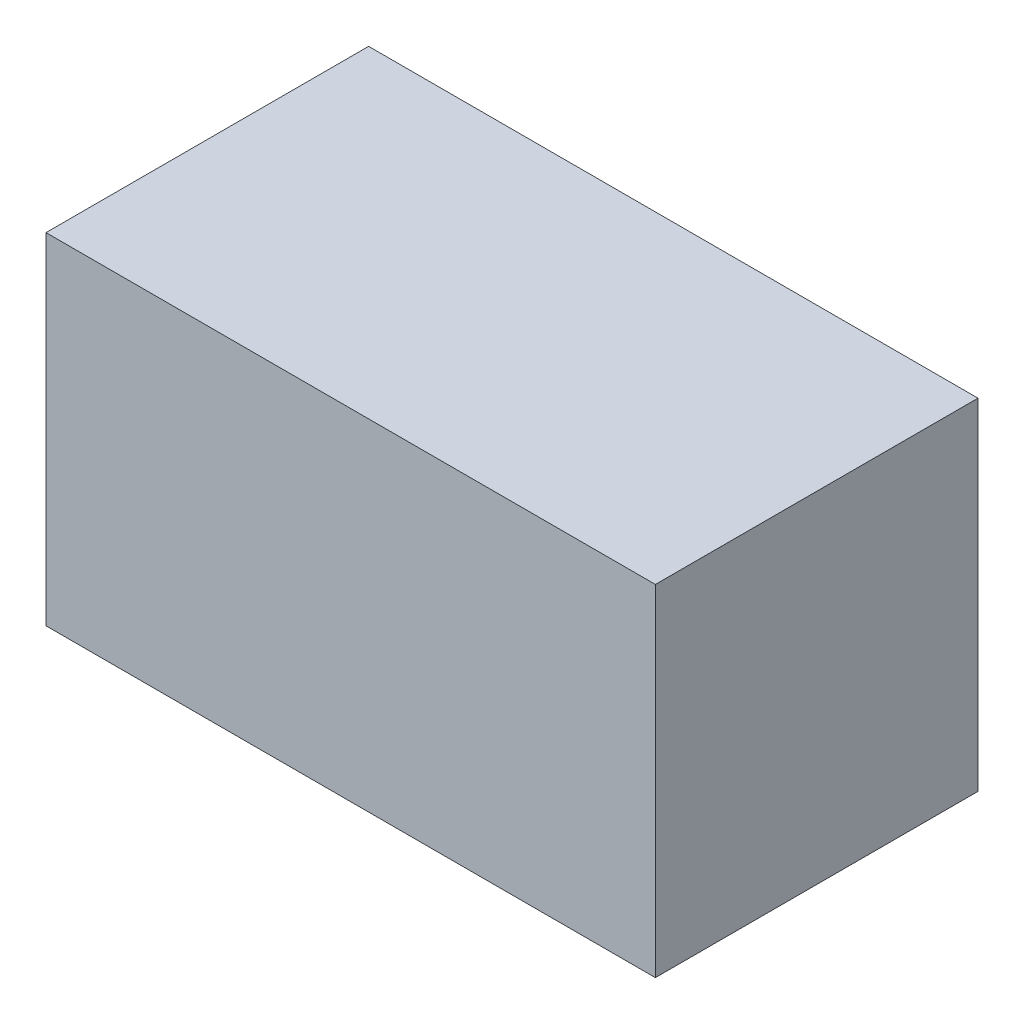
ISO-10303-21;
HEADER;
FILE_DESCRIPTION(('STEP AP214'),'2;1');
FILE_NAME('part.step','',(''),(''),'','','');
FILE_SCHEMA(('AUTOMOTIVE_DESIGN { 1 0 10303 214 1 1 1 1 }'));
ENDSEC;
DATA;
#1=APPLICATION_CONTEXT('core data for automotive mechanical design processes');
#2=APPLICATION_PROTOCOL_DEFINITION('international standard','automotive_design',2000,#1);
#3=PRODUCT_CONTEXT('',#1,'mechanical');
#4=PRODUCT('Part','Part','',(#3));
#5=PRODUCT_RELATED_PRODUCT_CATEGORY('part','',(#4));
#6=PRODUCT_DEFINITION_FORMATION('','',#4);
#7=PRODUCT_DEFINITION_CONTEXT('part definition',#1,'design');
#8=PRODUCT_DEFINITION('design','',#6,#7);
#9=PRODUCT_DEFINITION_SHAPE('','',#8);
#10=(LENGTH_UNIT() NAMED_UNIT(*) SI_UNIT(.MILLI.,.METRE.));
#11=(NAMED_UNIT(*) PLANE_ANGLE_UNIT() SI_UNIT($,.RADIAN.));
#12=(NAMED_UNIT(*) SI_UNIT($,.STERADIAN.) SOLID_ANGLE_UNIT());
#13=UNCERTAINTY_MEASURE_WITH_UNIT(LENGTH_MEASURE(1.E-05),#10,'distance_accuracy_value','');
#14=(GEOMETRIC_REPRESENTATION_CONTEXT(3) GLOBAL_UNCERTAINTY_ASSIGNED_CONTEXT((#13)) GLOBAL_UNIT_ASSIGNED_CONTEXT((#10,
#11,#12)) REPRESENTATION_CONTEXT('',''));
#15=CARTESIAN_POINT('',(0.,0.,0.));
#16=DIRECTION('',(0.,0.,1.));
#17=DIRECTION('',(1.,0.,0.));
#18=AXIS2_PLACEMENT_3D('',#15,#16,#17);
#19=CARTESIAN_POINT('',(0.85000084,0.47500032,0.90000074));
#20=DIRECTION('',(0.,0.,-1.));
#21=DIRECTION('',(-1.,0.,0.));
#22=AXIS2_PLACEMENT_3D('',#19,#20,#21);
#23=PLANE('',#22);
#24=DIRECTION('',(0.,1.,0.));
#25=VECTOR('',#24,1.);
#26=CARTESIAN_POINT('',(-0.85000084,0.47500032,0.90000074));
#27=LINE('',#26,#25);
#28=CARTESIAN_POINT('',(-0.85000084,0.47500032,0.90000074));
#29=VERTEX_POINT('',#28);
#30=CARTESIAN_POINT('',(-0.85000084,-0.47500032,0.90000074));
#31=VERTEX_POINT('',#30);
#32=EDGE_CURVE('E54',#29,#31,#27,.F.);
#33=ORIENTED_EDGE('',*,*,#32,.T.);
#34=DIRECTION('',(1.,0.,0.));
#35=VECTOR('',#34,1.);
#36=CARTESIAN_POINT('',(-0.85000084,-0.47500032,0.90000074));
#37=LINE('',#36,#35);
#38=CARTESIAN_POINT('',(0.85000084,-0.47500032,0.90000074));
#39=VERTEX_POINT('',#38);
#40=EDGE_CURVE('E56',#31,#39,#37,.T.);
#41=ORIENTED_EDGE('',*,*,#40,.T.);
#42=DIRECTION('',(0.,1.,0.));
#43=VECTOR('',#42,1.);
#44=CARTESIAN_POINT('',(0.85000084,-0.47500032,0.90000074));
#45=LINE('',#44,#43);
#46=CARTESIAN_POINT('',(0.85000084,0.47500032,0.90000074));
#47=VERTEX_POINT('',#46);
#48=EDGE_CURVE('E19',#39,#47,#45,.T.);
#49=ORIENTED_EDGE('',*,*,#48,.T.);
#50=DIRECTION('',(1.,0.,0.));
#51=VECTOR('',#50,1.);
#52=CARTESIAN_POINT('',(0.85000084,0.47500032,0.90000074));
#53=LINE('',#52,#51);
#54=EDGE_CURVE('E79',#47,#29,#53,.F.);
#55=ORIENTED_EDGE('',*,*,#54,.T.);
#56=EDGE_LOOP('',(#33,#41,#49,#55));
#57=FACE_BOUND('',#56,.T.);
#58=ADVANCED_FACE('F16',(#57),#23,.F.);
#59=CARTESIAN_POINT('',(0.85000084,-0.47500032,0.));
#60=DIRECTION('',(-1.,0.,0.));
#61=DIRECTION('',(0.,0.,1.));
#62=AXIS2_PLACEMENT_3D('',#59,#60,#61);
#63=PLANE('',#62);
#64=DIRECTION('',(0.,0.,-1.));
#65=VECTOR('',#64,1.);
#66=CARTESIAN_POINT('',(0.85000084,0.47500032,0.));
#67=LINE('',#66,#65);
#68=CARTESIAN_POINT('',(0.85000084,0.47500032,0.));
#69=VERTEX_POINT('',#68);
#70=EDGE_CURVE('E67',#69,#47,#67,.F.);
#71=ORIENTED_EDGE('',*,*,#70,.T.);
#72=ORIENTED_EDGE('',*,*,#48,.F.);
#73=DIRECTION('',(0.,0.,1.));
#74=VECTOR('',#73,1.);
#75=CARTESIAN_POINT('',(0.85000084,-0.47500032,0.));
#76=LINE('',#75,#74);
#77=CARTESIAN_POINT('',(0.85000084,-0.47500032,0.));
#78=VERTEX_POINT('',#77);
#79=EDGE_CURVE('E62',#39,#78,#76,.F.);
#80=ORIENTED_EDGE('',*,*,#79,.T.);
#81=DIRECTION('',(0.,1.,0.));
#82=VECTOR('',#81,1.);
#83=CARTESIAN_POINT('',(0.85000084,0.47500032,0.));
#84=LINE('',#83,#82);
#85=EDGE_CURVE('E82',#69,#78,#84,.F.);
#86=ORIENTED_EDGE('',*,*,#85,.F.);
#87=EDGE_LOOP('',(#71,#72,#80,#86));
#88=FACE_BOUND('',#87,.T.);
#89=ADVANCED_FACE('F64',(#88),#63,.F.);
#90=CARTESIAN_POINT('',(-0.85000084,-0.47500032,0.));
#91=DIRECTION('',(0.,1.,0.));
#92=DIRECTION('',(0.,0.,1.));
#93=AXIS2_PLACEMENT_3D('',#90,#91,#92);
#94=PLANE('',#93);
#95=ORIENTED_EDGE('',*,*,#79,.F.);
#96=ORIENTED_EDGE('',*,*,#40,.F.);
#97=DIRECTION('',(0.,0.,-1.));
#98=VECTOR('',#97,1.);
#99=CARTESIAN_POINT('',(-0.85000084,-0.47500032,0.));
#100=LINE('',#99,#98);
#101=CARTESIAN_POINT('',(-0.85000084,-0.47500032,0.));
#102=VERTEX_POINT('',#101);
#103=EDGE_CURVE('E74',#31,#102,#100,.T.);
#104=ORIENTED_EDGE('',*,*,#103,.T.);
#105=DIRECTION('',(-1.,0.,0.));
#106=VECTOR('',#105,1.);
#107=CARTESIAN_POINT('',(0.85000084,-0.47500032,0.));
#108=LINE('',#107,#106);
#109=EDGE_CURVE('E71',#78,#102,#108,.T.);
#110=ORIENTED_EDGE('',*,*,#109,.F.);
#111=EDGE_LOOP('',(#95,#96,#104,#110));
#112=FACE_BOUND('',#111,.T.);
#113=ADVANCED_FACE('F69',(#112),#94,.F.);
#114=CARTESIAN_POINT('',(-0.85000084,0.47500032,0.));
#115=DIRECTION('',(1.,0.,0.));
#116=DIRECTION('',(0.,0.,-1.));
#117=AXIS2_PLACEMENT_3D('',#114,#115,#116);
#118=PLANE('',#117);
#119=ORIENTED_EDGE('',*,*,#103,.F.);
#120=ORIENTED_EDGE('',*,*,#32,.F.);
#121=DIRECTION('',(0.,0.,-1.));
#122=VECTOR('',#121,1.);
#123=CARTESIAN_POINT('',(-0.85000084,0.47500032,0.));
#124=LINE('',#123,#122);
#125=CARTESIAN_POINT('',(-0.85000084,0.47500032,0.));
#126=VERTEX_POINT('',#125);
#127=EDGE_CURVE('E34',#29,#126,#124,.T.);
#128=ORIENTED_EDGE('',*,*,#127,.T.);
#129=DIRECTION('',(0.,1.,0.));
#130=VECTOR('',#129,1.);
#131=CARTESIAN_POINT('',(-0.85000084,0.47500032,0.));
#132=LINE('',#131,#130);
#133=EDGE_CURVE('E25',#102,#126,#132,.T.);
#134=ORIENTED_EDGE('',*,*,#133,.F.);
#135=EDGE_LOOP('',(#119,#120,#128,#134));
#136=FACE_BOUND('',#135,.T.);
#137=ADVANCED_FACE('F88',(#136),#118,.F.);
#138=CARTESIAN_POINT('',(0.85000084,0.47500032,0.));
#139=DIRECTION('',(0.,-1.,0.));
#140=DIRECTION('',(0.,0.,-1.));
#141=AXIS2_PLACEMENT_3D('',#138,#139,#140);
#142=PLANE('',#141);
#143=ORIENTED_EDGE('',*,*,#127,.F.);
#144=ORIENTED_EDGE('',*,*,#54,.F.);
#145=ORIENTED_EDGE('',*,*,#70,.F.);
#146=DIRECTION('',(-1.,0.,0.));
#147=VECTOR('',#146,1.);
#148=CARTESIAN_POINT('',(0.85000084,0.47500032,0.));
#149=LINE('',#148,#147);
#150=EDGE_CURVE('E11',#126,#69,#149,.F.);
#151=ORIENTED_EDGE('',*,*,#150,.F.);
#152=EDGE_LOOP('',(#143,#144,#145,#151));
#153=FACE_BOUND('',#152,.T.);
#154=ADVANCED_FACE('F90',(#153),#142,.F.);
#155=CARTESIAN_POINT('',(0.85000084,0.47500032,0.));
#156=DIRECTION('',(0.,0.,-1.));
#157=DIRECTION('',(-1.,0.,0.));
#158=AXIS2_PLACEMENT_3D('',#155,#156,#157);
#159=PLANE('',#158);
#160=ORIENTED_EDGE('',*,*,#133,.T.);
#161=ORIENTED_EDGE('',*,*,#150,.T.);
#162=ORIENTED_EDGE('',*,*,#85,.T.);
#163=ORIENTED_EDGE('',*,*,#109,.T.);
#164=EDGE_LOOP('',(#160,#161,#162,#163));
#165=FACE_BOUND('',#164,.T.);
#166=ADVANCED_FACE('F87',(#165),#159,.T.);
#167=CLOSED_SHELL('',(#58,#89,#113,#137,#154,#166));
#168=MANIFOLD_SOLID_BREP('B1',#167);
#169=ADVANCED_BREP_SHAPE_REPRESENTATION('',(#18,#168),#14);
#170=SHAPE_DEFINITION_REPRESENTATION(#9,#169);
ENDSEC;
END-ISO-10303-21;
